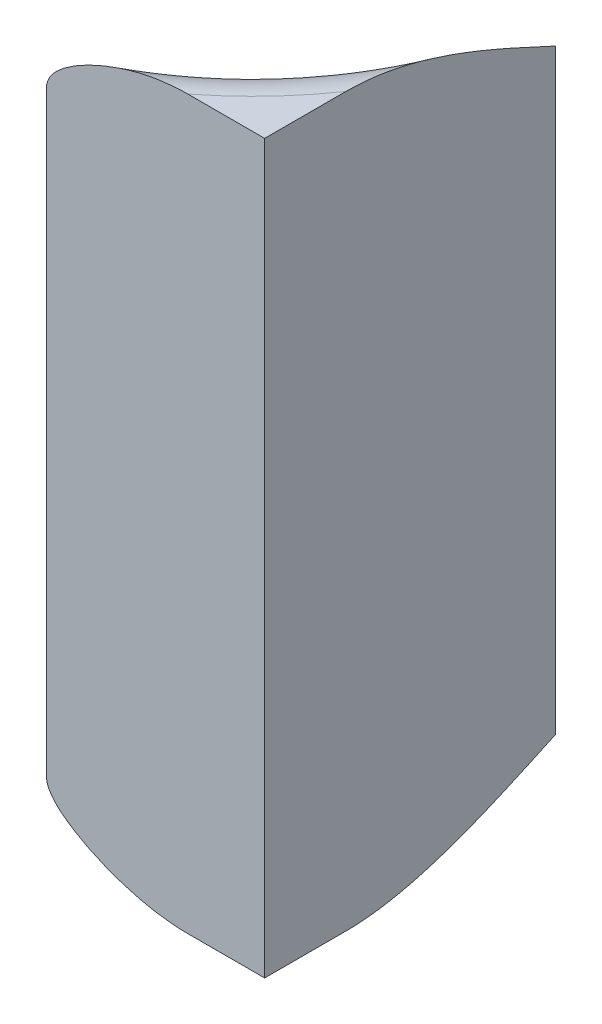
ISO-10303-21;
HEADER;
FILE_DESCRIPTION(('STEP AP214'),'2;1');
FILE_NAME('part.step','',(''),(''),'','','');
FILE_SCHEMA(('AUTOMOTIVE_DESIGN { 1 0 10303 214 1 1 1 1 }'));
ENDSEC;
DATA;
#1=APPLICATION_CONTEXT('core data for automotive mechanical design processes');
#2=APPLICATION_PROTOCOL_DEFINITION('international standard','automotive_design',2000,#1);
#3=PRODUCT_CONTEXT('',#1,'mechanical');
#4=PRODUCT('Part','Part','',(#3));
#5=PRODUCT_RELATED_PRODUCT_CATEGORY('part','',(#4));
#6=PRODUCT_DEFINITION_FORMATION('','',#4);
#7=PRODUCT_DEFINITION_CONTEXT('part definition',#1,'design');
#8=PRODUCT_DEFINITION('design','',#6,#7);
#9=PRODUCT_DEFINITION_SHAPE('','',#8);
#10=(LENGTH_UNIT() NAMED_UNIT(*) SI_UNIT(.MILLI.,.METRE.));
#11=(NAMED_UNIT(*) PLANE_ANGLE_UNIT() SI_UNIT($,.RADIAN.));
#12=(NAMED_UNIT(*) SI_UNIT($,.STERADIAN.) SOLID_ANGLE_UNIT());
#13=UNCERTAINTY_MEASURE_WITH_UNIT(LENGTH_MEASURE(1.E-05),#10,'distance_accuracy_value','');
#14=(GEOMETRIC_REPRESENTATION_CONTEXT(3) GLOBAL_UNCERTAINTY_ASSIGNED_CONTEXT((#13)) GLOBAL_UNIT_ASSIGNED_CONTEXT((#10,
#11,#12)) REPRESENTATION_CONTEXT('',''));
#15=CARTESIAN_POINT('',(0.,0.,0.));
#16=DIRECTION('',(0.,0.,1.));
#17=DIRECTION('',(1.,0.,0.));
#18=AXIS2_PLACEMENT_3D('',#15,#16,#17);
#19=CARTESIAN_POINT('',(7.58333333333001,-1.59,-7.4));
#20=DIRECTION('',(0.,1.,0.));
#21=DIRECTION('',(-1.,0.,0.));
#22=AXIS2_PLACEMENT_3D('',#19,#20,#21);
#23=TOROIDAL_SURFACE('',#22,0.506666666666998,0.0899999999999999);
#24=CARTESIAN_POINT('',(7.58333333332787,-1.59,-7.4000000000016));
#25=DIRECTION('',(0.,1.,0.));
#26=DIRECTION('',(0.,0.,1.));
#27=AXIS2_PLACEMENT_3D('',#24,#25,#26);
#28=CIRCLE('',#27,0.416666666669132);
#29=CARTESIAN_POINT('',(7.69999999999838,-1.59,-6.99999999999984));
#30=VERTEX_POINT('',#29);
#31=CARTESIAN_POINT('',(7.9999999999985,-1.59,-7.4));
#32=VERTEX_POINT('',#31);
#33=EDGE_CURVE('E73',#30,#32,#28,.T.);
#34=ORIENTED_EDGE('',*,*,#33,.F.);
#35=CARTESIAN_POINT('',(7.89431743438942,-1.5,-7.));
#36=CARTESIAN_POINT('',(7.88678338106183,-1.50000257689523,-7.));
#37=CARTESIAN_POINT('',(7.87925891688696,-1.50035567443863,-7.));
#38=CARTESIAN_POINT('',(7.86427287465657,-1.50168700961226,-7.));
#39=CARTESIAN_POINT('',(7.85681123629472,-1.50266455596775,-7.));
#40=CARTESIAN_POINT('',(7.8343841337617,-1.50645142527349,-7.));
#41=CARTESIAN_POINT('',(7.81955765596528,-1.51011148185725,-7.));
#42=CARTESIAN_POINT('',(7.79245860086913,-1.51872439377394,-7.));
#43=CARTESIAN_POINT('',(7.78010795689979,-1.52344165067617,-7.));
#44=CARTESIAN_POINT('',(7.75610618727793,-1.53429411076945,-7.));
#45=CARTESIAN_POINT('',(7.74445113580438,-1.54042016907073,-7.));
#46=CARTESIAN_POINT('',(7.72780897521364,-1.55139175619884,-7.));
#47=CARTESIAN_POINT('',(7.72231735002373,-1.55542956548335,-7.));
#48=CARTESIAN_POINT('',(7.71470266498958,-1.56226356939497,-7.));
#49=CARTESIAN_POINT('',(7.71225414260142,-1.56468981703379,-7.));
#50=CARTESIAN_POINT('',(7.70775962703489,-1.56989362601122,-7.));
#51=CARTESIAN_POINT('',(7.70571160837917,-1.57266929637726,-7.));
#52=CARTESIAN_POINT('',(7.70322987009971,-1.57711460086341,-7.));
#53=CARTESIAN_POINT('',(7.7025072339901,-1.57862028994568,-7.));
#54=CARTESIAN_POINT('',(7.70130828091125,-1.58172418480298,-7.));
#55=CARTESIAN_POINT('',(7.70083099698926,-1.58332199935807,-7.));
#56=CARTESIAN_POINT('',(7.7003396290887,-1.5857788046333,-7.));
#57=CARTESIAN_POINT('',(7.70021317394219,-1.58661601690182,-7.));
#58=CARTESIAN_POINT('',(7.7000429725344,-1.58830190819717,-7.));
#59=CARTESIAN_POINT('',(7.69999953665933,-1.58915061835462,-7.));
#60=CARTESIAN_POINT('',(7.69999999999961,-1.59000000000035,-7.));
#61=B_SPLINE_CURVE_WITH_KNOTS('',3,(#35,#36,#37,#38,#39,#40,#41,#42,#43,#44,#45,#46,#47,#48,#49,
#50,#51,#52,#53,#54,#55,#56,#57,#58,#59,#60),.UNSPECIFIED.,.F.,.F.,(4,2,2,2,2,2,2,2,2,2,2,2,4),
(0.,0.0225788096460651,0.0451326674054534,0.0907782215684329,0.130374817366714,0.16972129531537,
0.19008827818117,0.200409303675,0.210676699976314,0.215671790379442,0.220647040823237,
0.223183415172485,0.225729253918224),.UNSPECIFIED.);
#62=CARTESIAN_POINT('',(7.89431743438919,-1.5,-7.));
#63=VERTEX_POINT('',#62);
#64=EDGE_CURVE('E68',#63,#30,#61,.T.);
#65=ORIENTED_EDGE('',*,*,#64,.F.);
#66=CARTESIAN_POINT('',(7.58333333333001,-1.5,-7.4));
#67=DIRECTION('',(0.,1.,0.));
#68=DIRECTION('',(-1.,0.,0.));
#69=AXIS2_PLACEMENT_3D('',#66,#67,#68);
#70=CIRCLE('',#69,0.506666666666992);
#71=CARTESIAN_POINT('',(8.,-1.5,-7.11172929389312));
#72=VERTEX_POINT('',#71);
#73=EDGE_CURVE('E21',#72,#63,#70,.F.);
#74=ORIENTED_EDGE('',*,*,#73,.F.);
#75=CARTESIAN_POINT('',(7.9999999999985,-1.59,-7.4));
#76=CARTESIAN_POINT('',(7.99999999999904,-1.58942646348425,-7.3987659319644));
#77=CARTESIAN_POINT('',(7.99999999999954,-1.58885292363761,-7.39753187212373));
#78=CARTESIAN_POINT('',(8.00000000001021,-1.57561245210545,-7.36903846134883));
#79=CARTESIAN_POINT('',(8.00000000000268,-1.56298285951156,-7.34176487137191));
#80=CARTESIAN_POINT('',(7.99999999999732,-1.53953069792656,-7.28639982318779));
#81=CARTESIAN_POINT('',(7.99999999999947,-1.52870698305647,-7.25830889699594));
#82=CARTESIAN_POINT('',(8.00000000000031,-1.51489408365354,-7.21303952076176));
#83=CARTESIAN_POINT('',(8.00000000000008,-1.51052997028146,-7.19629446443788));
#84=CARTESIAN_POINT('',(7.99999999999992,-1.50378981110994,-7.16238876878099));
#85=CARTESIAN_POINT('',(7.99999999999998,-1.50141174149607,-7.14522857088371));
#86=CARTESIAN_POINT('',(8.00000000000001,-1.49982814325588,-7.11659396288003));
#87=CARTESIAN_POINT('',(8.,-1.49981959727449,-7.10516725665292));
#88=CARTESIAN_POINT('',(8.,-1.50139009882763,-7.08241440288963));
#89=CARTESIAN_POINT('',(8.,-1.50296658348045,-7.07108812279707));
#90=CARTESIAN_POINT('',(8.,-1.50725870226802,-7.05266875189914));
#91=CARTESIAN_POINT('',(8.,-1.5094055846796,-7.04544443976367));
#92=CARTESIAN_POINT('',(8.,-1.51473137559339,-7.03138042192805));
#93=CARTESIAN_POINT('',(8.,-1.51790890877277,-7.02454021785702));
#94=CARTESIAN_POINT('',(8.,-1.52443884953643,-7.01326965044144));
#95=CARTESIAN_POINT('',(8.,-1.52751935042223,-7.0086826247563));
#96=CARTESIAN_POINT('',(8.,-1.53436041775885,-7.00004403671223));
#97=CARTESIAN_POINT('',(8.,-1.53811998892831,-6.99599170552236));
#98=CARTESIAN_POINT('',(8.,-1.54543188882962,-6.98944200306168));
#99=CARTESIAN_POINT('',(8.,-1.54885228425234,-6.98679800721275));
#100=CARTESIAN_POINT('',(8.,-1.55608102887146,-6.98210160122734));
#101=CARTESIAN_POINT('',(8.,-1.55988918618205,-6.98004890039289));
#102=CARTESIAN_POINT('',(8.,-1.5678506144028,-6.9766509130585));
#103=CARTESIAN_POINT('',(8.,-1.57200646586004,-6.97531158288976));
#104=CARTESIAN_POINT('',(8.,-1.58050109224315,-6.97347517149535));
#105=CARTESIAN_POINT('',(8.,-1.58483973723059,-6.97297750199451));
#106=CARTESIAN_POINT('',(8.,-1.59294181758554,-6.97287406118883));
#107=CARTESIAN_POINT('',(8.,-1.59670423219795,-6.97315746171413));
#108=CARTESIAN_POINT('',(8.,-1.60412119915514,-6.97436584450682));
#109=CARTESIAN_POINT('',(8.,-1.60777582470661,-6.97529038036425));
#110=CARTESIAN_POINT('',(8.,-1.6148142201848,-6.9776987612977));
#111=CARTESIAN_POINT('',(8.,-1.61820185842519,-6.9791714576404));
#112=CARTESIAN_POINT('',(8.,-1.62472828978619,-6.98260485601426));
#113=CARTESIAN_POINT('',(8.,-1.62786642498021,-6.98456679530911));
#114=CARTESIAN_POINT('',(8.,-1.63507271379746,-6.98978081106602));
#115=CARTESIAN_POINT('',(8.,-1.63899555573869,-6.99323221613745));
#116=CARTESIAN_POINT('',(8.,-1.64620981143328,-7.00070636121121));
#117=CARTESIAN_POINT('',(8.,-1.64950481975734,-7.0047256042326));
#118=CARTESIAN_POINT('',(8.,-1.65248619787756,-7.00893530554002));
#119=B_SPLINE_CURVE_WITH_KNOTS('',3,(#75,#76,#77,#78,#79,#80,#81,#82,#83,#84,#85,#86,#87,#88,
#89,#90,#91,#92,#93,#94,#95,#96,#97,#98,#99,#100,#101,#102,#103,#104,#105,#106,#107,#108,#109,
#110,#111,#112,#113,#114,#115,#116,#117,#118),.UNSPECIFIED.,.F.,.F.,(4,2,2,2,2,2,2,2,2,2,2,2,2,
2,2,2,2,2,2,2,2,4),(0.,0.00408248290556503,0.0942588860618196,0.184377850391833,
0.236215222233763,0.287999706181359,0.322202141549142,0.356349362810156,0.378898897762522,
0.401418465072899,0.417941063328498,0.434439638841507,0.447359524124835,0.460273046730438,
0.473292765319107,0.486303380063665,0.497566283960228,0.50882135358146,0.519859017159666,
0.530924882495543,0.54652167686257,0.562026298239305),.UNSPECIFIED.);
#120=EDGE_CURVE('E65',#32,#72,#119,.T.);
#121=ORIENTED_EDGE('',*,*,#120,.F.);
#122=EDGE_LOOP('',(#34,#65,#74,#121));
#123=FACE_BOUND('',#122,.T.);
#124=ADVANCED_FACE('F17',(#123),#23,.T.);
#125=CARTESIAN_POINT('',(7.58333333332787,-2.41,-7.4000000000016));
#126=DIRECTION('',(0.,1.,0.));
#127=DIRECTION('',(0.,0.,1.));
#128=AXIS2_PLACEMENT_3D('',#125,#126,#127);
#129=CYLINDRICAL_SURFACE('',#128,0.416666666669132);
#130=DIRECTION('',(0.,-1.,0.));
#131=VECTOR('',#130,1.);
#132=CARTESIAN_POINT('',(7.7,-1.99999999999994,-7.));
#133=LINE('',#132,#131);
#134=CARTESIAN_POINT('',(7.69999999999892,-2.41,-7.));
#135=VERTEX_POINT('',#134);
#136=EDGE_CURVE('E84',#30,#135,#133,.T.);
#137=ORIENTED_EDGE('',*,*,#136,.F.);
#138=ORIENTED_EDGE('',*,*,#33,.T.);
#139=DIRECTION('',(0.,1.,0.));
#140=VECTOR('',#139,1.);
#141=CARTESIAN_POINT('',(8.,-2.00000000000054,-7.4));
#142=LINE('',#141,#140);
#143=CARTESIAN_POINT('',(7.9999999999985,-2.41,-7.4));
#144=VERTEX_POINT('',#143);
#145=EDGE_CURVE('E82',#144,#32,#142,.T.);
#146=ORIENTED_EDGE('',*,*,#145,.F.);
#147=CARTESIAN_POINT('',(7.58333333333001,-2.41,-7.4));
#148=DIRECTION('',(0.,1.,0.));
#149=DIRECTION('',(0.,0.,1.));
#150=AXIS2_PLACEMENT_3D('',#147,#148,#149);
#151=CIRCLE('',#150,0.416666666666997);
#152=EDGE_CURVE('E72',#135,#144,#151,.T.);
#153=ORIENTED_EDGE('',*,*,#152,.F.);
#154=EDGE_LOOP('',(#137,#138,#146,#153));
#155=FACE_BOUND('',#154,.T.);
#156=ADVANCED_FACE('F104',(#155),#129,.F.);
#157=CARTESIAN_POINT('',(7.89331743438961,-1.5,-7.11272929389202));
#158=DIRECTION('',(0.,1.,0.));
#159=DIRECTION('',(0.,0.,1.));
#160=AXIS2_PLACEMENT_3D('',#157,#158,#159);
#161=PLANE('',#160);
#162=DIRECTION('',(-1.,0.,0.));
#163=VECTOR('',#162,1.);
#164=CARTESIAN_POINT('',(7.84999999999893,-1.5,-7.));
#165=LINE('',#164,#163);
#166=CARTESIAN_POINT('',(8.,-1.5,-7.));
#167=VERTEX_POINT('',#166);
#168=EDGE_CURVE('E76',#167,#63,#165,.T.);
#169=ORIENTED_EDGE('',*,*,#168,.F.);
#170=DIRECTION('',(0.,0.,1.));
#171=VECTOR('',#170,1.);
#172=CARTESIAN_POINT('',(8.,-1.5,-7.2));
#173=LINE('',#172,#171);
#174=EDGE_CURVE('E74',#72,#167,#173,.T.);
#175=ORIENTED_EDGE('',*,*,#174,.F.);
#176=ORIENTED_EDGE('',*,*,#73,.T.);
#177=EDGE_LOOP('',(#169,#175,#176));
#178=FACE_BOUND('',#177,.T.);
#179=ADVANCED_FACE('F75',(#178),#161,.T.);
#180=CARTESIAN_POINT('',(7.58333333333001,-2.41,-7.4));
#181=DIRECTION('',(0.,-1.,0.));
#182=DIRECTION('',(0.,0.,-1.));
#183=AXIS2_PLACEMENT_3D('',#180,#181,#182);
#184=TOROIDAL_SURFACE('',#183,0.506666666666992,0.0899999999999992);
#185=CARTESIAN_POINT('',(7.58333333333001,-2.5,-7.4));
#186=DIRECTION('',(0.,-1.,0.));
#187=DIRECTION('',(0.,0.,-1.));
#188=AXIS2_PLACEMENT_3D('',#185,#186,#187);
#189=CIRCLE('',#188,0.506666666666994);
#190=CARTESIAN_POINT('',(7.89431743438928,-2.5,-7.00000000000026));
#191=VERTEX_POINT('',#190);
#192=CARTESIAN_POINT('',(8.,-2.5,-7.11172929389477));
#193=VERTEX_POINT('',#192);
#194=EDGE_CURVE('E121',#191,#193,#189,.F.);
#195=ORIENTED_EDGE('',*,*,#194,.F.);
#196=CARTESIAN_POINT('',(7.69999999999784,-2.41,-7.));
#197=CARTESIAN_POINT('',(7.69999242286718,-2.41179744020447,-7.));
#198=CARTESIAN_POINT('',(7.70019201367933,-2.41358197983579,-7.));
#199=CARTESIAN_POINT('',(7.70092701042398,-2.41704597855897,-7.));
#200=CARTESIAN_POINT('',(7.7014557685626,-2.41872681056903,-7.));
#201=CARTESIAN_POINT('',(7.70298307668687,-2.42248809473558,-7.));
#202=CARTESIAN_POINT('',(7.7040769878492,-2.42452839958886,-7.));
#203=CARTESIAN_POINT('',(7.70656855223289,-2.42843047637995,-7.));
#204=CARTESIAN_POINT('',(7.70796881069486,-2.43029050638506,-7.));
#205=CARTESIAN_POINT('',(7.71323590592019,-2.43656410542716,-7.));
#206=CARTESIAN_POINT('',(7.71760640546368,-2.44054368091172,-7.));
#207=CARTESIAN_POINT('',(7.72682625249034,-2.4478895207235,-7.));
#208=CARTESIAN_POINT('',(7.73167814429883,-2.45125222596013,-7.));
#209=CARTESIAN_POINT('',(7.74367620686635,-2.45882699945719,-7.));
#210=CARTESIAN_POINT('',(7.75095494357622,-2.46283059244184,-7.));
#211=CARTESIAN_POINT('',(7.76582541220368,-2.47021324720343,-7.));
#212=CARTESIAN_POINT('',(7.77341767971982,-2.47359118122704,-7.));
#213=CARTESIAN_POINT('',(7.79649886587154,-2.48286895184523,-7.));
#214=CARTESIAN_POINT('',(7.81233477189954,-2.4879375437972,-7.));
#215=CARTESIAN_POINT('',(7.83925638048751,-2.49438694776934,-7.));
#216=CARTESIAN_POINT('',(7.85018585906077,-2.49643271300571,-7.));
#217=CARTESIAN_POINT('',(7.87217205192401,-2.49923061064085,-7.));
#218=CARTESIAN_POINT('',(7.88322828526269,-2.49998661136524,-7.));
#219=CARTESIAN_POINT('',(7.89431743438943,-2.5,-7.));
#220=B_SPLINE_CURVE_WITH_KNOTS('',3,(#196,#197,#198,#199,#200,#201,#202,#203,#204,#205,#206,
#207,#208,#209,#210,#211,#212,#213,#214,#215,#216,#217,#218,#219),.UNSPECIFIED.,.F.,.F.,(4,2,2,
2,2,2,2,2,2,2,2,4),(0.,0.00536075382320408,0.0106166062475367,0.0175220325716442,
0.0244886399425453,0.0420846993037787,0.0597792898738505,0.0846486742987616,0.109562458701923,
0.159243487630331,0.192536219053472,0.225728920570628),.UNSPECIFIED.);
#221=EDGE_CURVE('E115',#135,#191,#220,.T.);
#222=ORIENTED_EDGE('',*,*,#221,.F.);
#223=ORIENTED_EDGE('',*,*,#152,.T.);
#224=CARTESIAN_POINT('',(8.,-2.5,-7.11172929389331));
#225=CARTESIAN_POINT('',(8.00000000000004,-2.49999182842818,-7.12226420750381));
#226=CARTESIAN_POINT('',(8.00000000000002,-2.49940282433437,-7.13277700192456));
#227=CARTESIAN_POINT('',(7.99999999999998,-2.49726599111461,-7.15367604192473));
#228=CARTESIAN_POINT('',(7.99999999999996,-2.4957210217608,-7.16406257107873));
#229=CARTESIAN_POINT('',(8.00000000000008,-2.48999308609058,-7.19476484291108));
#230=CARTESIAN_POINT('',(8.00000000000041,-2.48470744792433,-7.21486900485835));
#231=CARTESIAN_POINT('',(7.99999999999942,-2.46974800515174,-7.26244598700282));
#232=CARTESIAN_POINT('',(7.99999999999739,-2.45916406833895,-7.28961338372367));
#233=CARTESIAN_POINT('',(8.00000000000262,-2.43630890961602,-7.34329374460434));
#234=CARTESIAN_POINT('',(8.00000000000991,-2.4240317960039,-7.36980402462254));
#235=CARTESIAN_POINT('',(7.99999999999954,-2.41114707398825,-7.39753187914524));
#236=CARTESIAN_POINT('',(7.99999999999904,-2.41057353385867,-7.39876593924196));
#237=CARTESIAN_POINT('',(7.9999999999985,-2.41,-7.4));
#238=B_SPLINE_CURVE_WITH_KNOTS('',3,(#224,#225,#226,#227,#228,#229,#230,#231,#232,#233,#234,
#235,#236,#237),.UNSPECIFIED.,.F.,.F.,(4,2,2,2,2,2,4),(0.,0.0315568764344344,0.0630198037861065,
0.125216483289168,0.212547910956122,0.300191273586357,0.304273756561998),.UNSPECIFIED.);
#239=EDGE_CURVE('E77',#193,#144,#238,.T.);
#240=ORIENTED_EDGE('',*,*,#239,.F.);
#241=EDGE_LOOP('',(#195,#222,#223,#240));
#242=FACE_BOUND('',#241,.T.);
#243=ADVANCED_FACE('F110',(#242),#184,.T.);
#244=CARTESIAN_POINT('',(8.,-1.49899999999892,-6.999));
#245=DIRECTION('',(1.,0.,0.));
#246=DIRECTION('',(0.,-1.,0.));
#247=AXIS2_PLACEMENT_3D('',#244,#245,#246);
#248=PLANE('',#247);
#249=ORIENTED_EDGE('',*,*,#145,.T.);
#250=ORIENTED_EDGE('',*,*,#120,.T.);
#251=ORIENTED_EDGE('',*,*,#174,.T.);
#252=DIRECTION('',(0.,1.,0.));
#253=VECTOR('',#252,1.);
#254=CARTESIAN_POINT('',(8.,-1.99999999999994,-7.));
#255=LINE('',#254,#253);
#256=CARTESIAN_POINT('',(8.,-2.5,-7.));
#257=VERTEX_POINT('',#256);
#258=EDGE_CURVE('E36',#257,#167,#255,.T.);
#259=ORIENTED_EDGE('',*,*,#258,.F.);
#260=DIRECTION('',(0.,0.,1.));
#261=VECTOR('',#260,1.);
#262=CARTESIAN_POINT('',(8.,-2.5,-7.05586464694601));
#263=LINE('',#262,#261);
#264=EDGE_CURVE('E27',#193,#257,#263,.T.);
#265=ORIENTED_EDGE('',*,*,#264,.F.);
#266=ORIENTED_EDGE('',*,*,#239,.T.);
#267=EDGE_LOOP('',(#249,#250,#251,#259,#265,#266));
#268=FACE_BOUND('',#267,.T.);
#269=ADVANCED_FACE('F79',(#268),#248,.T.);
#270=CARTESIAN_POINT('',(7.69899999999786,-1.4989999999998,-7.));
#271=DIRECTION('',(0.,0.,1.));
#272=DIRECTION('',(0.,-1.,0.));
#273=AXIS2_PLACEMENT_3D('',#270,#271,#272);
#274=PLANE('',#273);
#275=ORIENTED_EDGE('',*,*,#258,.T.);
#276=ORIENTED_EDGE('',*,*,#168,.T.);
#277=ORIENTED_EDGE('',*,*,#64,.T.);
#278=ORIENTED_EDGE('',*,*,#136,.T.);
#279=ORIENTED_EDGE('',*,*,#221,.T.);
#280=DIRECTION('',(-1.,0.,0.));
#281=VECTOR('',#280,1.);
#282=CARTESIAN_POINT('',(7.9471587171948,-2.5,-7.));
#283=LINE('',#282,#281);
#284=EDGE_CURVE('E11',#257,#191,#283,.T.);
#285=ORIENTED_EDGE('',*,*,#284,.F.);
#286=EDGE_LOOP('',(#275,#276,#277,#278,#279,#285));
#287=FACE_BOUND('',#286,.T.);
#288=ADVANCED_FACE('F123',(#287),#274,.T.);
#289=CARTESIAN_POINT('',(7.89331743438961,-2.5,-6.999));
#290=DIRECTION('',(0.,-1.,0.));
#291=DIRECTION('',(0.,0.,-1.));
#292=AXIS2_PLACEMENT_3D('',#289,#290,#291);
#293=PLANE('',#292);
#294=ORIENTED_EDGE('',*,*,#264,.T.);
#295=ORIENTED_EDGE('',*,*,#284,.T.);
#296=ORIENTED_EDGE('',*,*,#194,.T.);
#297=EDGE_LOOP('',(#294,#295,#296));
#298=FACE_BOUND('',#297,.T.);
#299=ADVANCED_FACE('F19',(#298),#293,.T.);
#300=CLOSED_SHELL('',(#124,#156,#179,#243,#269,#288,#299));
#301=MANIFOLD_SOLID_BREP('B1',#300);
#302=ADVANCED_BREP_SHAPE_REPRESENTATION('',(#18,#301),#14);
#303=SHAPE_DEFINITION_REPRESENTATION(#9,#302);
ENDSEC;
END-ISO-10303-21;
